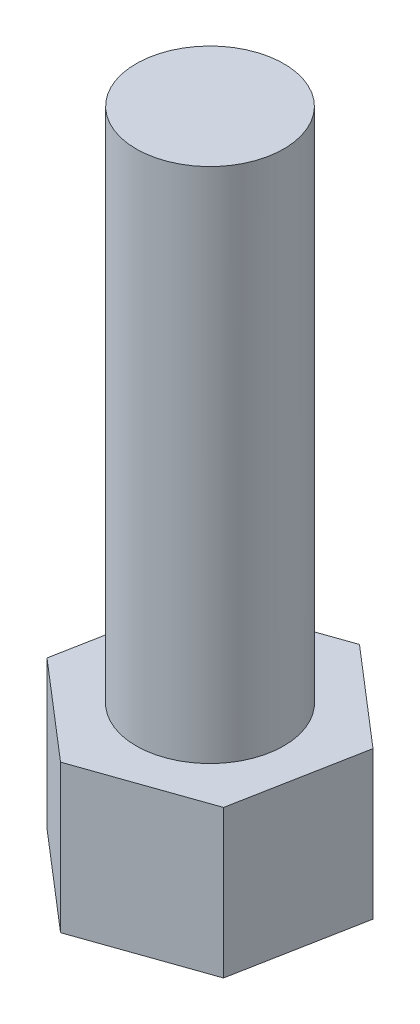
ISO-10303-21;
HEADER;
FILE_DESCRIPTION(('STEP AP214'),'2;1');
FILE_NAME('part.step','',(''),(''),'','','');
FILE_SCHEMA(('AUTOMOTIVE_DESIGN { 1 0 10303 214 1 1 1 1 }'));
ENDSEC;
DATA;
#1=APPLICATION_CONTEXT('core data for automotive mechanical design processes');
#2=APPLICATION_PROTOCOL_DEFINITION('international standard','automotive_design',2000,#1);
#3=PRODUCT_CONTEXT('',#1,'mechanical');
#4=PRODUCT('Part','Part','',(#3));
#5=PRODUCT_RELATED_PRODUCT_CATEGORY('part','',(#4));
#6=PRODUCT_DEFINITION_FORMATION('','',#4);
#7=PRODUCT_DEFINITION_CONTEXT('part definition',#1,'design');
#8=PRODUCT_DEFINITION('design','',#6,#7);
#9=PRODUCT_DEFINITION_SHAPE('','',#8);
#10=(LENGTH_UNIT() NAMED_UNIT(*) SI_UNIT(.MILLI.,.METRE.));
#11=(NAMED_UNIT(*) PLANE_ANGLE_UNIT() SI_UNIT($,.RADIAN.));
#12=(NAMED_UNIT(*) SI_UNIT($,.STERADIAN.) SOLID_ANGLE_UNIT());
#13=UNCERTAINTY_MEASURE_WITH_UNIT(LENGTH_MEASURE(1.E-05),#10,'distance_accuracy_value','');
#14=(GEOMETRIC_REPRESENTATION_CONTEXT(3) GLOBAL_UNCERTAINTY_ASSIGNED_CONTEXT((#13)) GLOBAL_UNIT_ASSIGNED_CONTEXT((#10,
#11,#12)) REPRESENTATION_CONTEXT('',''));
#15=CARTESIAN_POINT('',(0.,0.,0.));
#16=DIRECTION('',(0.,0.,1.));
#17=DIRECTION('',(1.,0.,0.));
#18=AXIS2_PLACEMENT_3D('',#15,#16,#17);
#19=CARTESIAN_POINT('',(0.321879677095072,2.,-1.70187939451455));
#20=DIRECTION('',(-0.652230101823144,0.,0.758021038148525));
#21=DIRECTION('',(-0.758021038148527,0.,-0.652230101823148));
#22=AXIS2_PLACEMENT_3D('',#19,#20,#21);
#23=PLANE('',#22);
#24=DIRECTION('',(0.758021038148527,0.,0.652230101823148));
#25=VECTOR('',#24,1.);
#26=CARTESIAN_POINT('',(0.321879677095072,0.,-1.70187939451455));
#27=LINE('',#26,#25);
#28=CARTESIAN_POINT('',(0.321879677095072,0.,-1.70187939451455));
#29=VERTEX_POINT('',#28);
#30=CARTESIAN_POINT('',(1.63481062837439,0.,-0.572183719931049));
#31=VERTEX_POINT('',#30);
#32=EDGE_CURVE('E118',#29,#31,#27,.T.);
#33=ORIENTED_EDGE('',*,*,#32,.F.);
#34=DIRECTION('',(0.,-1.,0.));
#35=VECTOR('',#34,1.);
#36=CARTESIAN_POINT('',(0.321879677095072,2.,-1.70187939451455));
#37=LINE('',#36,#35);
#38=CARTESIAN_POINT('',(0.321879677095072,2.,-1.70187939451455));
#39=VERTEX_POINT('',#38);
#40=EDGE_CURVE('E117',#39,#29,#37,.T.);
#41=ORIENTED_EDGE('',*,*,#40,.F.);
#42=DIRECTION('',(0.758021038148527,0.,0.652230101823148));
#43=VECTOR('',#42,1.);
#44=CARTESIAN_POINT('',(0.321879677095072,2.,-1.70187939451455));
#45=LINE('',#44,#43);
#46=CARTESIAN_POINT('',(1.63481062837439,2.,-0.572183719931049));
#47=VERTEX_POINT('',#46);
#48=EDGE_CURVE('E131',#39,#47,#45,.T.);
#49=ORIENTED_EDGE('',*,*,#48,.T.);
#50=DIRECTION('',(0.,-1.,0.));
#51=VECTOR('',#50,1.);
#52=CARTESIAN_POINT('',(1.63481062837439,2.,-0.572183719931049));
#53=LINE('',#52,#51);
#54=EDGE_CURVE('E11',#47,#31,#53,.T.);
#55=ORIENTED_EDGE('',*,*,#54,.T.);
#56=EDGE_LOOP('',(#33,#41,#49,#55));
#57=FACE_BOUND('',#56,.T.);
#58=ADVANCED_FACE('F35',(#57),#23,.F.);
#59=CARTESIAN_POINT('',(1.63481062837439,2.,-0.572183719931049));
#60=DIRECTION('',(-0.98258052655125,0.,-0.185837318217495));
#61=DIRECTION('',(0.185837318217489,0.,-0.98258052655125));
#62=AXIS2_PLACEMENT_3D('',#59,#60,#61);
#63=PLANE('',#62);
#64=DIRECTION('',(-0.185837318217489,0.,0.98258052655125));
#65=VECTOR('',#64,1.);
#66=CARTESIAN_POINT('',(1.63481062837439,0.,-0.572183719931049));
#67=LINE('',#66,#65);
#68=CARTESIAN_POINT('',(1.31293095127935,0.,1.12969567458351));
#69=VERTEX_POINT('',#68);
#70=EDGE_CURVE('E120',#31,#69,#67,.T.);
#71=ORIENTED_EDGE('',*,*,#70,.F.);
#72=ORIENTED_EDGE('',*,*,#54,.F.);
#73=DIRECTION('',(-0.185837318217489,0.,0.98258052655125));
#74=VECTOR('',#73,1.);
#75=CARTESIAN_POINT('',(1.63481062837439,2.,-0.572183719931049));
#76=LINE('',#75,#74);
#77=CARTESIAN_POINT('',(1.31293095127935,2.,1.12969567458351));
#78=VERTEX_POINT('',#77);
#79=EDGE_CURVE('E83',#47,#78,#76,.T.);
#80=ORIENTED_EDGE('',*,*,#79,.T.);
#81=DIRECTION('',(0.,-1.,0.));
#82=VECTOR('',#81,1.);
#83=CARTESIAN_POINT('',(1.31293095127935,2.,1.12969567458351));
#84=LINE('',#83,#82);
#85=EDGE_CURVE('E43',#78,#69,#84,.T.);
#86=ORIENTED_EDGE('',*,*,#85,.T.);
#87=EDGE_LOOP('',(#71,#72,#80,#86));
#88=FACE_BOUND('',#87,.T.);
#89=ADVANCED_FACE('F137',(#88),#63,.F.);
#90=CARTESIAN_POINT('',(1.31293095127935,2.,1.12969567458351));
#91=DIRECTION('',(-0.330350424728107,0.,-0.94385835636602));
#92=DIRECTION('',(0.943858356366017,0.,-0.330350424728102));
#93=AXIS2_PLACEMENT_3D('',#90,#91,#92);
#94=PLANE('',#93);
#95=DIRECTION('',(-0.943858356366017,0.,0.330350424728102));
#96=VECTOR('',#95,1.);
#97=CARTESIAN_POINT('',(1.31293095127935,0.,1.12969567458351));
#98=LINE('',#97,#96);
#99=CARTESIAN_POINT('',(-0.321879677095044,0.,1.70187939451455));
#100=VERTEX_POINT('',#99);
#101=EDGE_CURVE('E124',#69,#100,#98,.T.);
#102=ORIENTED_EDGE('',*,*,#101,.F.);
#103=ORIENTED_EDGE('',*,*,#85,.F.);
#104=DIRECTION('',(-0.943858356366017,0.,0.330350424728102));
#105=VECTOR('',#104,1.);
#106=CARTESIAN_POINT('',(1.31293095127935,2.,1.12969567458351));
#107=LINE('',#106,#105);
#108=CARTESIAN_POINT('',(-0.321879677095044,2.,1.70187939451455));
#109=VERTEX_POINT('',#108);
#110=EDGE_CURVE('E111',#78,#109,#107,.T.);
#111=ORIENTED_EDGE('',*,*,#110,.T.);
#112=DIRECTION('',(0.,-1.,0.));
#113=VECTOR('',#112,1.);
#114=CARTESIAN_POINT('',(-0.321879677095044,2.,1.70187939451455));
#115=LINE('',#114,#113);
#116=EDGE_CURVE('E105',#109,#100,#115,.T.);
#117=ORIENTED_EDGE('',*,*,#116,.T.);
#118=EDGE_LOOP('',(#102,#103,#111,#117));
#119=FACE_BOUND('',#118,.T.);
#120=ADVANCED_FACE('F170',(#119),#94,.F.);
#121=CARTESIAN_POINT('',(-0.321879677095044,2.,1.70187939451455));
#122=DIRECTION('',(0.652230101823143,0.,-0.758021038148526));
#123=DIRECTION('',(0.758021038148528,0.,0.652230101823149));
#124=AXIS2_PLACEMENT_3D('',#121,#122,#123);
#125=PLANE('',#124);
#126=DIRECTION('',(-0.758021038148527,0.,-0.652230101823148));
#127=VECTOR('',#126,1.);
#128=CARTESIAN_POINT('',(-0.321879677095044,0.,1.70187939451455));
#129=LINE('',#128,#127);
#130=CARTESIAN_POINT('',(-1.63481062837445,0.,0.572183719931035));
#131=VERTEX_POINT('',#130);
#132=EDGE_CURVE('E127',#100,#131,#129,.T.);
#133=ORIENTED_EDGE('',*,*,#132,.F.);
#134=ORIENTED_EDGE('',*,*,#116,.F.);
#135=DIRECTION('',(-0.758021038148527,0.,-0.652230101823148));
#136=VECTOR('',#135,1.);
#137=CARTESIAN_POINT('',(-0.321879677095044,2.,1.70187939451455));
#138=LINE('',#137,#136);
#139=CARTESIAN_POINT('',(-1.63481062837445,2.,0.572183719931035));
#140=VERTEX_POINT('',#139);
#141=EDGE_CURVE('E95',#109,#140,#138,.T.);
#142=ORIENTED_EDGE('',*,*,#141,.T.);
#143=DIRECTION('',(0.,-1.,0.));
#144=VECTOR('',#143,1.);
#145=CARTESIAN_POINT('',(-1.63481062837445,2.,0.572183719931035));
#146=LINE('',#145,#144);
#147=EDGE_CURVE('E100',#140,#131,#146,.T.);
#148=ORIENTED_EDGE('',*,*,#147,.T.);
#149=EDGE_LOOP('',(#133,#134,#142,#148));
#150=FACE_BOUND('',#149,.T.);
#151=ADVANCED_FACE('F108',(#150),#125,.F.);
#152=CARTESIAN_POINT('',(-1.63481062837445,2.,0.572183719931035));
#153=DIRECTION('',(0.98258052655125,0.,0.185837318217495));
#154=DIRECTION('',(-0.185837318217489,0.,0.98258052655125));
#155=AXIS2_PLACEMENT_3D('',#152,#153,#154);
#156=PLANE('',#155);
#157=DIRECTION('',(0.185837318217489,0.,-0.98258052655125));
#158=VECTOR('',#157,1.);
#159=CARTESIAN_POINT('',(-1.63481062837445,0.,0.572183719931035));
#160=LINE('',#159,#158);
#161=CARTESIAN_POINT('',(-1.31293095127935,0.,-1.1296956745836));
#162=VERTEX_POINT('',#161);
#163=EDGE_CURVE('E102',#131,#162,#160,.T.);
#164=ORIENTED_EDGE('',*,*,#163,.F.);
#165=ORIENTED_EDGE('',*,*,#147,.F.);
#166=DIRECTION('',(0.185837318217489,0.,-0.98258052655125));
#167=VECTOR('',#166,1.);
#168=CARTESIAN_POINT('',(-1.63481062837445,2.,0.572183719931035));
#169=LINE('',#168,#167);
#170=CARTESIAN_POINT('',(-1.31293095127935,2.,-1.1296956745836));
#171=VERTEX_POINT('',#170);
#172=EDGE_CURVE('E91',#140,#171,#169,.T.);
#173=ORIENTED_EDGE('',*,*,#172,.T.);
#174=DIRECTION('',(0.,-1.,0.));
#175=VECTOR('',#174,1.);
#176=CARTESIAN_POINT('',(-1.31293095127935,2.,-1.1296956745836));
#177=LINE('',#176,#175);
#178=EDGE_CURVE('E106',#171,#162,#177,.T.);
#179=ORIENTED_EDGE('',*,*,#178,.T.);
#180=EDGE_LOOP('',(#164,#165,#173,#179));
#181=FACE_BOUND('',#180,.T.);
#182=ADVANCED_FACE('F101',(#181),#156,.F.);
#183=CARTESIAN_POINT('',(-1.31293095127935,2.,-1.1296956745836));
#184=DIRECTION('',(0.330350424728106,0.,0.94385835636602));
#185=DIRECTION('',(-0.943858356366017,0.,0.330350424728102));
#186=AXIS2_PLACEMENT_3D('',#183,#184,#185);
#187=PLANE('',#186);
#188=DIRECTION('',(0.943858356366017,0.,-0.330350424728102));
#189=VECTOR('',#188,1.);
#190=CARTESIAN_POINT('',(-1.31293095127935,0.,-1.1296956745836));
#191=LINE('',#190,#189);
#192=EDGE_CURVE('E71',#162,#29,#191,.T.);
#193=ORIENTED_EDGE('',*,*,#192,.F.);
#194=ORIENTED_EDGE('',*,*,#178,.F.);
#195=DIRECTION('',(0.943858356366017,0.,-0.330350424728102));
#196=VECTOR('',#195,1.);
#197=CARTESIAN_POINT('',(-1.31293095127935,2.,-1.1296956745836));
#198=LINE('',#197,#196);
#199=EDGE_CURVE('E51',#171,#39,#198,.T.);
#200=ORIENTED_EDGE('',*,*,#199,.T.);
#201=ORIENTED_EDGE('',*,*,#40,.T.);
#202=EDGE_LOOP('',(#193,#194,#200,#201));
#203=FACE_BOUND('',#202,.T.);
#204=ADVANCED_FACE('F180',(#203),#187,.F.);
#205=CARTESIAN_POINT('',(0.,2.,0.));
#206=DIRECTION('',(0.,1.,0.));
#207=DIRECTION('',(0.,0.,-1.));
#208=AXIS2_PLACEMENT_3D('',#205,#206,#207);
#209=PLANE('',#208);
#210=CARTESIAN_POINT('',(0.,2.,0.));
#211=DIRECTION('',(0.,-1.,0.));
#212=DIRECTION('',(0.,0.,-1.));
#213=AXIS2_PLACEMENT_3D('',#210,#211,#212);
#214=CIRCLE('',#213,1.);
#215=CARTESIAN_POINT('',(0.,2.,-1.));
#216=VERTEX_POINT('',#215);
#217=EDGE_CURVE('E121',#216,#216,#214,.T.);
#218=ORIENTED_EDGE('',*,*,#217,.T.);
#219=EDGE_LOOP('',(#218));
#220=FACE_BOUND('',#219,.T.);
#221=ORIENTED_EDGE('',*,*,#48,.F.);
#222=ORIENTED_EDGE('',*,*,#199,.F.);
#223=ORIENTED_EDGE('',*,*,#172,.F.);
#224=ORIENTED_EDGE('',*,*,#141,.F.);
#225=ORIENTED_EDGE('',*,*,#110,.F.);
#226=ORIENTED_EDGE('',*,*,#79,.F.);
#227=EDGE_LOOP('',(#221,#222,#223,#224,#225,#226));
#228=FACE_BOUND('',#227,.T.);
#229=ADVANCED_FACE('F93',(#220,#228),#209,.T.);
#230=CARTESIAN_POINT('',(0.,0.,0.));
#231=DIRECTION('',(0.,1.,0.));
#232=DIRECTION('',(0.,0.,-1.));
#233=AXIS2_PLACEMENT_3D('',#230,#231,#232);
#234=PLANE('',#233);
#235=ORIENTED_EDGE('',*,*,#32,.T.);
#236=ORIENTED_EDGE('',*,*,#70,.T.);
#237=ORIENTED_EDGE('',*,*,#101,.T.);
#238=ORIENTED_EDGE('',*,*,#132,.T.);
#239=ORIENTED_EDGE('',*,*,#163,.T.);
#240=ORIENTED_EDGE('',*,*,#192,.T.);
#241=EDGE_LOOP('',(#235,#236,#237,#238,#239,#240));
#242=FACE_BOUND('',#241,.T.);
#243=ADVANCED_FACE('F139',(#242),#234,.F.);
#244=CARTESIAN_POINT('',(0.,5.,0.));
#245=DIRECTION('',(0.,-1.,0.));
#246=DIRECTION('',(0.,0.,1.));
#247=AXIS2_PLACEMENT_3D('',#244,#245,#246);
#248=CYLINDRICAL_SURFACE('',#247,1.);
#249=ORIENTED_EDGE('',*,*,#217,.F.);
#250=EDGE_LOOP('',(#249));
#251=FACE_BOUND('',#250,.T.);
#252=CARTESIAN_POINT('',(0.,9.00000000000001,0.));
#253=DIRECTION('',(0.,1.,0.));
#254=DIRECTION('',(0.,0.,1.));
#255=AXIS2_PLACEMENT_3D('',#252,#253,#254);
#256=CIRCLE('',#255,1.00000000000003);
#257=CARTESIAN_POINT('',(0.,9.00000000000001,1.00000000000004));
#258=VERTEX_POINT('',#257);
#259=EDGE_CURVE('E148',#258,#258,#256,.T.);
#260=ORIENTED_EDGE('',*,*,#259,.F.);
#261=EDGE_LOOP('',(#260));
#262=FACE_BOUND('',#261,.T.);
#263=ADVANCED_FACE('F154',(#251,#262),#248,.T.);
#264=CARTESIAN_POINT('',(0.,9.00000000000001,0.));
#265=DIRECTION('',(0.,1.,0.));
#266=DIRECTION('',(0.,0.,1.));
#267=AXIS2_PLACEMENT_3D('',#264,#265,#266);
#268=PLANE('',#267);
#269=ORIENTED_EDGE('',*,*,#259,.T.);
#270=EDGE_LOOP('',(#269));
#271=FACE_BOUND('',#270,.T.);
#272=ADVANCED_FACE('F152',(#271),#268,.T.);
#273=CLOSED_SHELL('',(#58,#89,#120,#151,#182,#204,#229,#243,#263,#272));
#274=MANIFOLD_SOLID_BREP('B2',#273);
#275=ADVANCED_BREP_SHAPE_REPRESENTATION('',(#18,#274),#14);
#276=SHAPE_DEFINITION_REPRESENTATION(#9,#275);
ENDSEC;
END-ISO-10303-21;
